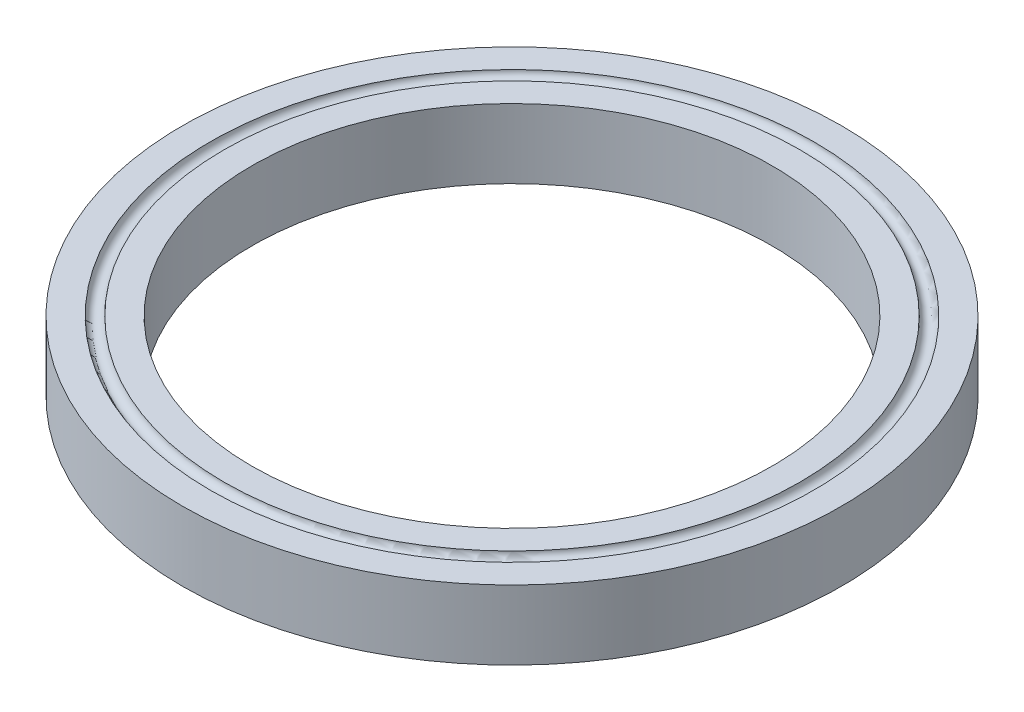
ISO-10303-21;
HEADER;
FILE_DESCRIPTION(('STEP AP214'),'2;1');
FILE_NAME('part.step','',(''),(''),'','','');
FILE_SCHEMA(('AUTOMOTIVE_DESIGN { 1 0 10303 214 1 1 1 1 }'));
ENDSEC;
DATA;
#1=APPLICATION_CONTEXT('core data for automotive mechanical design processes');
#2=APPLICATION_PROTOCOL_DEFINITION('international standard','automotive_design',2000,#1);
#3=PRODUCT_CONTEXT('',#1,'mechanical');
#4=PRODUCT('Part','Part','',(#3));
#5=PRODUCT_RELATED_PRODUCT_CATEGORY('part','',(#4));
#6=PRODUCT_DEFINITION_FORMATION('','',#4);
#7=PRODUCT_DEFINITION_CONTEXT('part definition',#1,'design');
#8=PRODUCT_DEFINITION('design','',#6,#7);
#9=PRODUCT_DEFINITION_SHAPE('','',#8);
#10=(LENGTH_UNIT() NAMED_UNIT(*) SI_UNIT(.MILLI.,.METRE.));
#11=(NAMED_UNIT(*) PLANE_ANGLE_UNIT() SI_UNIT($,.RADIAN.));
#12=(NAMED_UNIT(*) SI_UNIT($,.STERADIAN.) SOLID_ANGLE_UNIT());
#13=UNCERTAINTY_MEASURE_WITH_UNIT(LENGTH_MEASURE(1.E-05),#10,'distance_accuracy_value','');
#14=(GEOMETRIC_REPRESENTATION_CONTEXT(3) GLOBAL_UNCERTAINTY_ASSIGNED_CONTEXT((#13)) GLOBAL_UNIT_ASSIGNED_CONTEXT((#10,
#11,#12)) REPRESENTATION_CONTEXT('',''));
#15=CARTESIAN_POINT('',(0.,0.,0.));
#16=DIRECTION('',(0.,0.,1.));
#17=DIRECTION('',(1.,0.,0.));
#18=AXIS2_PLACEMENT_3D('',#15,#16,#17);
#19=CARTESIAN_POINT('',(0.,0.,0.));
#20=DIRECTION('',(0.,1.,0.));
#21=DIRECTION('',(0.,0.,1.));
#22=AXIS2_PLACEMENT_3D('',#19,#20,#21);
#23=CYLINDRICAL_SURFACE('',#22,37.5);
#24=CARTESIAN_POINT('',(0.,-10.,0.));
#25=DIRECTION('',(0.,1.,0.));
#26=DIRECTION('',(0.,0.,1.));
#27=AXIS2_PLACEMENT_3D('',#24,#25,#26);
#28=CIRCLE('',#27,37.5);
#29=CARTESIAN_POINT('',(0.,-10.,37.5));
#30=VERTEX_POINT('',#29);
#31=EDGE_CURVE('E18',#30,#30,#28,.F.);
#32=ORIENTED_EDGE('',*,*,#31,.T.);
#33=EDGE_LOOP('',(#32));
#34=FACE_BOUND('',#33,.T.);
#35=CARTESIAN_POINT('',(0.,0.,0.));
#36=DIRECTION('',(0.,1.,0.));
#37=DIRECTION('',(0.,0.,1.));
#38=AXIS2_PLACEMENT_3D('',#35,#36,#37);
#39=CIRCLE('',#38,37.5);
#40=CARTESIAN_POINT('',(0.,0.,37.5));
#41=VERTEX_POINT('',#40);
#42=EDGE_CURVE('E43',#41,#41,#39,.T.);
#43=ORIENTED_EDGE('',*,*,#42,.T.);
#44=EDGE_LOOP('',(#43));
#45=FACE_BOUND('',#44,.T.);
#46=ADVANCED_FACE('F15',(#34,#45),#23,.F.);
#47=CARTESIAN_POINT('',(41.5,-10.,0.));
#48=DIRECTION('',(0.,1.,0.));
#49=DIRECTION('',(0.,0.,1.));
#50=AXIS2_PLACEMENT_3D('',#47,#48,#49);
#51=PLANE('',#50);
#52=CARTESIAN_POINT('',(0.,-10.,0.));
#53=DIRECTION('',(0.,1.,0.));
#54=DIRECTION('',(0.,0.,1.));
#55=AXIS2_PLACEMENT_3D('',#52,#53,#54);
#56=CIRCLE('',#55,41.5);
#57=CARTESIAN_POINT('',(0.,-10.,41.5));
#58=VERTEX_POINT('',#57);
#59=EDGE_CURVE('E41',#58,#58,#56,.F.);
#60=ORIENTED_EDGE('',*,*,#59,.T.);
#61=EDGE_LOOP('',(#60));
#62=FACE_BOUND('',#61,.T.);
#63=ORIENTED_EDGE('',*,*,#31,.F.);
#64=EDGE_LOOP('',(#63));
#65=FACE_BOUND('',#64,.T.);
#66=ADVANCED_FACE('F51',(#62,#65),#51,.F.);
#67=CARTESIAN_POINT('',(37.5,0.,0.));
#68=DIRECTION('',(0.,-1.,0.));
#69=DIRECTION('',(0.,0.,-1.));
#70=AXIS2_PLACEMENT_3D('',#67,#68,#69);
#71=PLANE('',#70);
#72=CARTESIAN_POINT('',(0.,0.,0.));
#73=DIRECTION('',(0.,1.,0.));
#74=DIRECTION('',(0.,0.,1.));
#75=AXIS2_PLACEMENT_3D('',#72,#73,#74);
#76=CIRCLE('',#75,41.5);
#77=CARTESIAN_POINT('',(0.,0.,41.5));
#78=VERTEX_POINT('',#77);
#79=EDGE_CURVE('E38',#78,#78,#76,.T.);
#80=ORIENTED_EDGE('',*,*,#79,.T.);
#81=EDGE_LOOP('',(#80));
#82=FACE_BOUND('',#81,.T.);
#83=ORIENTED_EDGE('',*,*,#42,.F.);
#84=EDGE_LOOP('',(#83));
#85=FACE_BOUND('',#84,.T.);
#86=ADVANCED_FACE('F53',(#82,#85),#71,.F.);
#87=CARTESIAN_POINT('',(0.,-10.,0.));
#88=DIRECTION('',(0.,1.,0.));
#89=DIRECTION('',(0.,0.,1.));
#90=AXIS2_PLACEMENT_3D('',#87,#88,#89);
#91=TOROIDAL_SURFACE('',#90,42.5,1.);
#92=CARTESIAN_POINT('',(0.,-10.,0.));
#93=DIRECTION('',(0.,1.,0.));
#94=DIRECTION('',(0.,0.,1.));
#95=AXIS2_PLACEMENT_3D('',#92,#93,#94);
#96=CIRCLE('',#95,43.5);
#97=CARTESIAN_POINT('',(0.,-10.,43.5));
#98=VERTEX_POINT('',#97);
#99=EDGE_CURVE('E35',#98,#98,#96,.F.);
#100=ORIENTED_EDGE('',*,*,#99,.T.);
#101=EDGE_LOOP('',(#100));
#102=FACE_BOUND('',#101,.T.);
#103=ORIENTED_EDGE('',*,*,#59,.F.);
#104=EDGE_LOOP('',(#103));
#105=FACE_BOUND('',#104,.T.);
#106=ADVANCED_FACE('F60',(#102,#105),#91,.F.);
#107=CARTESIAN_POINT('',(0.,0.,0.));
#108=DIRECTION('',(0.,1.,0.));
#109=DIRECTION('',(0.,0.,1.));
#110=AXIS2_PLACEMENT_3D('',#107,#108,#109);
#111=TOROIDAL_SURFACE('',#110,42.5,1.);
#112=ORIENTED_EDGE('',*,*,#79,.F.);
#113=EDGE_LOOP('',(#112));
#114=FACE_BOUND('',#113,.T.);
#115=CARTESIAN_POINT('',(0.,0.,0.));
#116=DIRECTION('',(0.,1.,0.));
#117=DIRECTION('',(0.,0.,1.));
#118=AXIS2_PLACEMENT_3D('',#115,#116,#117);
#119=CIRCLE('',#118,43.5);
#120=CARTESIAN_POINT('',(0.,0.,43.5));
#121=VERTEX_POINT('',#120);
#122=EDGE_CURVE('E27',#121,#121,#119,.T.);
#123=ORIENTED_EDGE('',*,*,#122,.T.);
#124=EDGE_LOOP('',(#123));
#125=FACE_BOUND('',#124,.T.);
#126=ADVANCED_FACE('F77',(#114,#125),#111,.F.);
#127=CARTESIAN_POINT('',(47.5,-10.,0.));
#128=DIRECTION('',(0.,1.,0.));
#129=DIRECTION('',(0.,0.,1.));
#130=AXIS2_PLACEMENT_3D('',#127,#128,#129);
#131=PLANE('',#130);
#132=CARTESIAN_POINT('',(0.,-10.,0.));
#133=DIRECTION('',(0.,1.,0.));
#134=DIRECTION('',(0.,0.,1.));
#135=AXIS2_PLACEMENT_3D('',#132,#133,#134);
#136=CIRCLE('',#135,47.5);
#137=CARTESIAN_POINT('',(0.,-10.,47.5));
#138=VERTEX_POINT('',#137);
#139=EDGE_CURVE('E22',#138,#138,#136,.T.);
#140=ORIENTED_EDGE('',*,*,#139,.F.);
#141=EDGE_LOOP('',(#140));
#142=FACE_BOUND('',#141,.T.);
#143=ORIENTED_EDGE('',*,*,#99,.F.);
#144=EDGE_LOOP('',(#143));
#145=FACE_BOUND('',#144,.T.);
#146=ADVANCED_FACE('F71',(#142,#145),#131,.F.);
#147=CARTESIAN_POINT('',(43.5,0.,0.));
#148=DIRECTION('',(0.,-1.,0.));
#149=DIRECTION('',(0.,0.,-1.));
#150=AXIS2_PLACEMENT_3D('',#147,#148,#149);
#151=PLANE('',#150);
#152=CARTESIAN_POINT('',(0.,0.,0.));
#153=DIRECTION('',(0.,1.,0.));
#154=DIRECTION('',(0.,0.,1.));
#155=AXIS2_PLACEMENT_3D('',#152,#153,#154);
#156=CIRCLE('',#155,47.5);
#157=CARTESIAN_POINT('',(0.,0.,47.5));
#158=VERTEX_POINT('',#157);
#159=EDGE_CURVE('E10',#158,#158,#156,.F.);
#160=ORIENTED_EDGE('',*,*,#159,.F.);
#161=EDGE_LOOP('',(#160));
#162=FACE_BOUND('',#161,.T.);
#163=ORIENTED_EDGE('',*,*,#122,.F.);
#164=EDGE_LOOP('',(#163));
#165=FACE_BOUND('',#164,.T.);
#166=ADVANCED_FACE('F65',(#162,#165),#151,.F.);
#167=CARTESIAN_POINT('',(0.,0.,0.));
#168=DIRECTION('',(0.,1.,0.));
#169=DIRECTION('',(0.,0.,1.));
#170=AXIS2_PLACEMENT_3D('',#167,#168,#169);
#171=CYLINDRICAL_SURFACE('',#170,47.5);
#172=ORIENTED_EDGE('',*,*,#139,.T.);
#173=EDGE_LOOP('',(#172));
#174=FACE_BOUND('',#173,.T.);
#175=ORIENTED_EDGE('',*,*,#159,.T.);
#176=EDGE_LOOP('',(#175));
#177=FACE_BOUND('',#176,.T.);
#178=ADVANCED_FACE('F63',(#174,#177),#171,.T.);
#179=CLOSED_SHELL('',(#46,#66,#86,#106,#126,#146,#166,#178));
#180=MANIFOLD_SOLID_BREP('B1',#179);
#181=ADVANCED_BREP_SHAPE_REPRESENTATION('',(#18,#180),#14);
#182=SHAPE_DEFINITION_REPRESENTATION(#9,#181);
ENDSEC;
END-ISO-10303-21;
